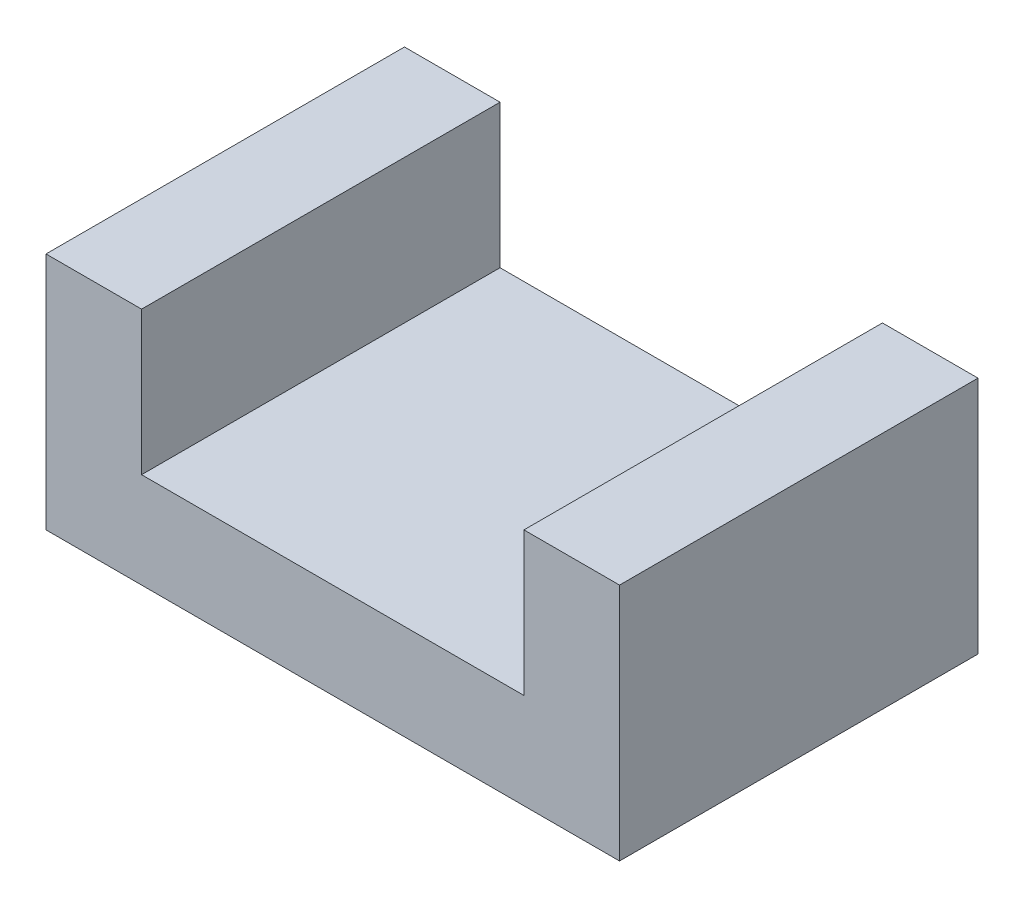
ISO-10303-21;
HEADER;
FILE_DESCRIPTION(('STEP AP214'),'2;1');
FILE_NAME('part.step','',(''),(''),'','','');
FILE_SCHEMA(('AUTOMOTIVE_DESIGN { 1 0 10303 214 1 1 1 1 }'));
ENDSEC;
DATA;
#1=APPLICATION_CONTEXT('core data for automotive mechanical design processes');
#2=APPLICATION_PROTOCOL_DEFINITION('international standard','automotive_design',2000,#1);
#3=PRODUCT_CONTEXT('',#1,'mechanical');
#4=PRODUCT('Part','Part','',(#3));
#5=PRODUCT_RELATED_PRODUCT_CATEGORY('part','',(#4));
#6=PRODUCT_DEFINITION_FORMATION('','',#4);
#7=PRODUCT_DEFINITION_CONTEXT('part definition',#1,'design');
#8=PRODUCT_DEFINITION('design','',#6,#7);
#9=PRODUCT_DEFINITION_SHAPE('','',#8);
#10=(LENGTH_UNIT() NAMED_UNIT(*) SI_UNIT(.MILLI.,.METRE.));
#11=(NAMED_UNIT(*) PLANE_ANGLE_UNIT() SI_UNIT($,.RADIAN.));
#12=(NAMED_UNIT(*) SI_UNIT($,.STERADIAN.) SOLID_ANGLE_UNIT());
#13=UNCERTAINTY_MEASURE_WITH_UNIT(LENGTH_MEASURE(1.E-05),#10,'distance_accuracy_value','');
#14=(GEOMETRIC_REPRESENTATION_CONTEXT(3) GLOBAL_UNCERTAINTY_ASSIGNED_CONTEXT((#13)) GLOBAL_UNIT_ASSIGNED_CONTEXT((#10,
#11,#12)) REPRESENTATION_CONTEXT('',''));
#15=CARTESIAN_POINT('',(0.,0.,0.));
#16=DIRECTION('',(0.,0.,1.));
#17=DIRECTION('',(1.,0.,0.));
#18=AXIS2_PLACEMENT_3D('',#15,#16,#17);
#19=CARTESIAN_POINT('',(0.,4.,0.));
#20=DIRECTION('',(0.,-1.,0.));
#21=DIRECTION('',(0.,0.,-1.));
#22=AXIS2_PLACEMENT_3D('',#19,#20,#21);
#23=PLANE('',#22);
#24=DIRECTION('',(0.,0.,1.));
#25=VECTOR('',#24,1.);
#26=CARTESIAN_POINT('',(20.,4.,-15.));
#27=LINE('',#26,#25);
#28=CARTESIAN_POINT('',(20.,4.,-15.));
#29=VERTEX_POINT('',#28);
#30=CARTESIAN_POINT('',(20.,4.,0.));
#31=VERTEX_POINT('',#30);
#32=EDGE_CURVE('E126',#29,#31,#27,.T.);
#33=ORIENTED_EDGE('',*,*,#32,.F.);
#34=DIRECTION('',(-1.,0.,0.));
#35=VECTOR('',#34,1.);
#36=CARTESIAN_POINT('',(0.,4.,-15.));
#37=LINE('',#36,#35);
#38=CARTESIAN_POINT('',(4.,4.,-15.));
#39=VERTEX_POINT('',#38);
#40=EDGE_CURVE('E130',#29,#39,#37,.T.);
#41=ORIENTED_EDGE('',*,*,#40,.T.);
#42=DIRECTION('',(0.,0.,-1.));
#43=VECTOR('',#42,1.);
#44=CARTESIAN_POINT('',(4.,4.,-15.));
#45=LINE('',#44,#43);
#46=CARTESIAN_POINT('',(4.,4.,0.));
#47=VERTEX_POINT('',#46);
#48=EDGE_CURVE('E60',#47,#39,#45,.T.);
#49=ORIENTED_EDGE('',*,*,#48,.F.);
#50=DIRECTION('',(1.,0.,0.));
#51=VECTOR('',#50,1.);
#52=CARTESIAN_POINT('',(0.,4.,0.));
#53=LINE('',#52,#51);
#54=EDGE_CURVE('E55',#47,#31,#53,.T.);
#55=ORIENTED_EDGE('',*,*,#54,.T.);
#56=EDGE_LOOP('',(#33,#41,#49,#55));
#57=FACE_BOUND('',#56,.T.);
#58=ADVANCED_FACE('F39',(#57),#23,.F.);
#59=CARTESIAN_POINT('',(0.,4.,0.));
#60=DIRECTION('',(1.,0.,0.));
#61=DIRECTION('',(0.,0.,-1.));
#62=AXIS2_PLACEMENT_3D('',#59,#60,#61);
#63=PLANE('',#62);
#64=DIRECTION('',(0.,0.,1.));
#65=VECTOR('',#64,1.);
#66=CARTESIAN_POINT('',(0.,0.,0.));
#67=LINE('',#66,#65);
#68=CARTESIAN_POINT('',(0.,0.,-15.));
#69=VERTEX_POINT('',#68);
#70=CARTESIAN_POINT('',(0.,0.,0.));
#71=VERTEX_POINT('',#70);
#72=EDGE_CURVE('E160',#69,#71,#67,.T.);
#73=ORIENTED_EDGE('',*,*,#72,.T.);
#74=DIRECTION('',(0.,-1.,0.));
#75=VECTOR('',#74,1.);
#76=CARTESIAN_POINT('',(0.,4.,0.));
#77=LINE('',#76,#75);
#78=CARTESIAN_POINT('',(0.,10.,0.));
#79=VERTEX_POINT('',#78);
#80=EDGE_CURVE('E11',#79,#71,#77,.T.);
#81=ORIENTED_EDGE('',*,*,#80,.F.);
#82=DIRECTION('',(0.,0.,1.));
#83=VECTOR('',#82,1.);
#84=CARTESIAN_POINT('',(0.,10.,-15.));
#85=LINE('',#84,#83);
#86=CARTESIAN_POINT('',(0.,10.,-15.));
#87=VERTEX_POINT('',#86);
#88=EDGE_CURVE('E143',#87,#79,#85,.T.);
#89=ORIENTED_EDGE('',*,*,#88,.F.);
#90=DIRECTION('',(0.,-1.,0.));
#91=VECTOR('',#90,1.);
#92=CARTESIAN_POINT('',(0.,4.,-15.));
#93=LINE('',#92,#91);
#94=EDGE_CURVE('E166',#87,#69,#93,.T.);
#95=ORIENTED_EDGE('',*,*,#94,.T.);
#96=EDGE_LOOP('',(#73,#81,#89,#95));
#97=FACE_BOUND('',#96,.T.);
#98=ADVANCED_FACE('F41',(#97),#63,.F.);
#99=CARTESIAN_POINT('',(0.,4.,0.));
#100=DIRECTION('',(0.,0.,-1.));
#101=DIRECTION('',(-1.,0.,0.));
#102=AXIS2_PLACEMENT_3D('',#99,#100,#101);
#103=PLANE('',#102);
#104=DIRECTION('',(1.,0.,0.));
#105=VECTOR('',#104,1.);
#106=CARTESIAN_POINT('',(0.,0.,0.));
#107=LINE('',#106,#105);
#108=CARTESIAN_POINT('',(24.,0.,0.));
#109=VERTEX_POINT('',#108);
#110=EDGE_CURVE('E170',#71,#109,#107,.T.);
#111=ORIENTED_EDGE('',*,*,#110,.T.);
#112=DIRECTION('',(0.,-1.,0.));
#113=VECTOR('',#112,1.);
#114=CARTESIAN_POINT('',(24.,4.,0.));
#115=LINE('',#114,#113);
#116=CARTESIAN_POINT('',(24.,10.,0.));
#117=VERTEX_POINT('',#116);
#118=EDGE_CURVE('E48',#117,#109,#115,.T.);
#119=ORIENTED_EDGE('',*,*,#118,.F.);
#120=DIRECTION('',(1.,0.,0.));
#121=VECTOR('',#120,1.);
#122=CARTESIAN_POINT('',(24.,10.,0.));
#123=LINE('',#122,#121);
#124=CARTESIAN_POINT('',(20.,10.,0.));
#125=VERTEX_POINT('',#124);
#126=EDGE_CURVE('E115',#125,#117,#123,.T.);
#127=ORIENTED_EDGE('',*,*,#126,.F.);
#128=DIRECTION('',(0.,-1.,0.));
#129=VECTOR('',#128,1.);
#130=CARTESIAN_POINT('',(20.,10.,0.));
#131=LINE('',#130,#129);
#132=EDGE_CURVE('E110',#125,#31,#131,.T.);
#133=ORIENTED_EDGE('',*,*,#132,.T.);
#134=ORIENTED_EDGE('',*,*,#54,.F.);
#135=DIRECTION('',(0.,-1.,0.));
#136=VECTOR('',#135,1.);
#137=CARTESIAN_POINT('',(4.,10.,0.));
#138=LINE('',#137,#136);
#139=CARTESIAN_POINT('',(4.,10.,0.));
#140=VERTEX_POINT('',#139);
#141=EDGE_CURVE('E156',#140,#47,#138,.T.);
#142=ORIENTED_EDGE('',*,*,#141,.F.);
#143=DIRECTION('',(1.,0.,0.));
#144=VECTOR('',#143,1.);
#145=CARTESIAN_POINT('',(0.,10.,0.));
#146=LINE('',#145,#144);
#147=EDGE_CURVE('E147',#79,#140,#146,.T.);
#148=ORIENTED_EDGE('',*,*,#147,.F.);
#149=ORIENTED_EDGE('',*,*,#80,.T.);
#150=EDGE_LOOP('',(#111,#119,#127,#133,#134,#142,#148,#149));
#151=FACE_BOUND('',#150,.T.);
#152=ADVANCED_FACE('F204',(#151),#103,.F.);
#153=CARTESIAN_POINT('',(24.,4.,0.));
#154=DIRECTION('',(-1.,0.,0.));
#155=DIRECTION('',(0.,0.,1.));
#156=AXIS2_PLACEMENT_3D('',#153,#154,#155);
#157=PLANE('',#156);
#158=DIRECTION('',(0.,0.,-1.));
#159=VECTOR('',#158,1.);
#160=CARTESIAN_POINT('',(24.,0.,0.));
#161=LINE('',#160,#159);
#162=CARTESIAN_POINT('',(24.,0.,-15.));
#163=VERTEX_POINT('',#162);
#164=EDGE_CURVE('E173',#109,#163,#161,.T.);
#165=ORIENTED_EDGE('',*,*,#164,.T.);
#166=DIRECTION('',(0.,-1.,0.));
#167=VECTOR('',#166,1.);
#168=CARTESIAN_POINT('',(24.,4.,-15.));
#169=LINE('',#168,#167);
#170=CARTESIAN_POINT('',(24.,10.,-15.));
#171=VERTEX_POINT('',#170);
#172=EDGE_CURVE('E181',#171,#163,#169,.T.);
#173=ORIENTED_EDGE('',*,*,#172,.F.);
#174=DIRECTION('',(0.,0.,-1.));
#175=VECTOR('',#174,1.);
#176=CARTESIAN_POINT('',(24.,10.,-15.));
#177=LINE('',#176,#175);
#178=EDGE_CURVE('E122',#117,#171,#177,.T.);
#179=ORIENTED_EDGE('',*,*,#178,.F.);
#180=ORIENTED_EDGE('',*,*,#118,.T.);
#181=EDGE_LOOP('',(#165,#173,#179,#180));
#182=FACE_BOUND('',#181,.T.);
#183=ADVANCED_FACE('F187',(#182),#157,.F.);
#184=CARTESIAN_POINT('',(0.,4.,-15.));
#185=DIRECTION('',(0.,0.,1.));
#186=DIRECTION('',(1.,0.,0.));
#187=AXIS2_PLACEMENT_3D('',#184,#185,#186);
#188=PLANE('',#187);
#189=DIRECTION('',(-1.,0.,0.));
#190=VECTOR('',#189,1.);
#191=CARTESIAN_POINT('',(0.,0.,-15.));
#192=LINE('',#191,#190);
#193=EDGE_CURVE('E163',#163,#69,#192,.T.);
#194=ORIENTED_EDGE('',*,*,#193,.T.);
#195=ORIENTED_EDGE('',*,*,#94,.F.);
#196=DIRECTION('',(-1.,0.,0.));
#197=VECTOR('',#196,1.);
#198=CARTESIAN_POINT('',(4.,10.,-15.));
#199=LINE('',#198,#197);
#200=CARTESIAN_POINT('',(4.,10.,-15.));
#201=VERTEX_POINT('',#200);
#202=EDGE_CURVE('E135',#201,#87,#199,.T.);
#203=ORIENTED_EDGE('',*,*,#202,.F.);
#204=DIRECTION('',(0.,-1.,0.));
#205=VECTOR('',#204,1.);
#206=CARTESIAN_POINT('',(4.,10.,-15.));
#207=LINE('',#206,#205);
#208=EDGE_CURVE('E152',#201,#39,#207,.T.);
#209=ORIENTED_EDGE('',*,*,#208,.T.);
#210=ORIENTED_EDGE('',*,*,#40,.F.);
#211=DIRECTION('',(0.,-1.,0.));
#212=VECTOR('',#211,1.);
#213=CARTESIAN_POINT('',(20.,10.,-15.));
#214=LINE('',#213,#212);
#215=CARTESIAN_POINT('',(20.,10.,-15.));
#216=VERTEX_POINT('',#215);
#217=EDGE_CURVE('E108',#216,#29,#214,.T.);
#218=ORIENTED_EDGE('',*,*,#217,.F.);
#219=DIRECTION('',(-1.,0.,0.));
#220=VECTOR('',#219,1.);
#221=CARTESIAN_POINT('',(20.,10.,-15.));
#222=LINE('',#221,#220);
#223=EDGE_CURVE('E116',#171,#216,#222,.T.);
#224=ORIENTED_EDGE('',*,*,#223,.F.);
#225=ORIENTED_EDGE('',*,*,#172,.T.);
#226=EDGE_LOOP('',(#194,#195,#203,#209,#210,#218,#224,#225));
#227=FACE_BOUND('',#226,.T.);
#228=ADVANCED_FACE('F128',(#227),#188,.F.);
#229=CARTESIAN_POINT('',(0.,0.,0.));
#230=DIRECTION('',(0.,-1.,0.));
#231=DIRECTION('',(0.,0.,-1.));
#232=AXIS2_PLACEMENT_3D('',#229,#230,#231);
#233=PLANE('',#232);
#234=ORIENTED_EDGE('',*,*,#72,.F.);
#235=ORIENTED_EDGE('',*,*,#193,.F.);
#236=ORIENTED_EDGE('',*,*,#164,.F.);
#237=ORIENTED_EDGE('',*,*,#110,.F.);
#238=EDGE_LOOP('',(#234,#235,#236,#237));
#239=FACE_BOUND('',#238,.T.);
#240=ADVANCED_FACE('F192',(#239),#233,.T.);
#241=CARTESIAN_POINT('',(4.,10.,-15.));
#242=DIRECTION('',(-1.,0.,0.));
#243=DIRECTION('',(0.,0.,1.));
#244=AXIS2_PLACEMENT_3D('',#241,#242,#243);
#245=PLANE('',#244);
#246=ORIENTED_EDGE('',*,*,#48,.T.);
#247=ORIENTED_EDGE('',*,*,#208,.F.);
#248=DIRECTION('',(0.,0.,-1.));
#249=VECTOR('',#248,1.);
#250=CARTESIAN_POINT('',(4.,10.,-15.));
#251=LINE('',#250,#249);
#252=EDGE_CURVE('E150',#140,#201,#251,.T.);
#253=ORIENTED_EDGE('',*,*,#252,.F.);
#254=ORIENTED_EDGE('',*,*,#141,.T.);
#255=EDGE_LOOP('',(#246,#247,#253,#254));
#256=FACE_BOUND('',#255,.T.);
#257=ADVANCED_FACE('F202',(#256),#245,.F.);
#258=CARTESIAN_POINT('',(0.,10.,0.));
#259=DIRECTION('',(0.,1.,0.));
#260=DIRECTION('',(0.,0.,1.));
#261=AXIS2_PLACEMENT_3D('',#258,#259,#260);
#262=PLANE('',#261);
#263=ORIENTED_EDGE('',*,*,#202,.T.);
#264=ORIENTED_EDGE('',*,*,#88,.T.);
#265=ORIENTED_EDGE('',*,*,#147,.T.);
#266=ORIENTED_EDGE('',*,*,#252,.T.);
#267=EDGE_LOOP('',(#263,#264,#265,#266));
#268=FACE_BOUND('',#267,.T.);
#269=ADVANCED_FACE('F198',(#268),#262,.T.);
#270=CARTESIAN_POINT('',(20.,10.,-15.));
#271=DIRECTION('',(1.,0.,0.));
#272=DIRECTION('',(0.,0.,-1.));
#273=AXIS2_PLACEMENT_3D('',#270,#271,#272);
#274=PLANE('',#273);
#275=ORIENTED_EDGE('',*,*,#32,.T.);
#276=ORIENTED_EDGE('',*,*,#132,.F.);
#277=DIRECTION('',(0.,0.,1.));
#278=VECTOR('',#277,1.);
#279=CARTESIAN_POINT('',(20.,10.,-15.));
#280=LINE('',#279,#278);
#281=EDGE_CURVE('E104',#216,#125,#280,.T.);
#282=ORIENTED_EDGE('',*,*,#281,.F.);
#283=ORIENTED_EDGE('',*,*,#217,.T.);
#284=EDGE_LOOP('',(#275,#276,#282,#283));
#285=FACE_BOUND('',#284,.T.);
#286=ADVANCED_FACE('F106',(#285),#274,.F.);
#287=CARTESIAN_POINT('',(0.,10.,0.));
#288=DIRECTION('',(0.,-1.,0.));
#289=DIRECTION('',(0.,0.,-1.));
#290=AXIS2_PLACEMENT_3D('',#287,#288,#289);
#291=PLANE('',#290);
#292=ORIENTED_EDGE('',*,*,#223,.T.);
#293=ORIENTED_EDGE('',*,*,#281,.T.);
#294=ORIENTED_EDGE('',*,*,#126,.T.);
#295=ORIENTED_EDGE('',*,*,#178,.T.);
#296=EDGE_LOOP('',(#292,#293,#294,#295));
#297=FACE_BOUND('',#296,.T.);
#298=ADVANCED_FACE('F120',(#297),#291,.F.);
#299=CLOSED_SHELL('',(#58,#98,#152,#183,#228,#240,#257,#269,#286,#298));
#300=MANIFOLD_SOLID_BREP('B2',#299);
#301=ADVANCED_BREP_SHAPE_REPRESENTATION('',(#18,#300),#14);
#302=SHAPE_DEFINITION_REPRESENTATION(#9,#301);
ENDSEC;
END-ISO-10303-21;
